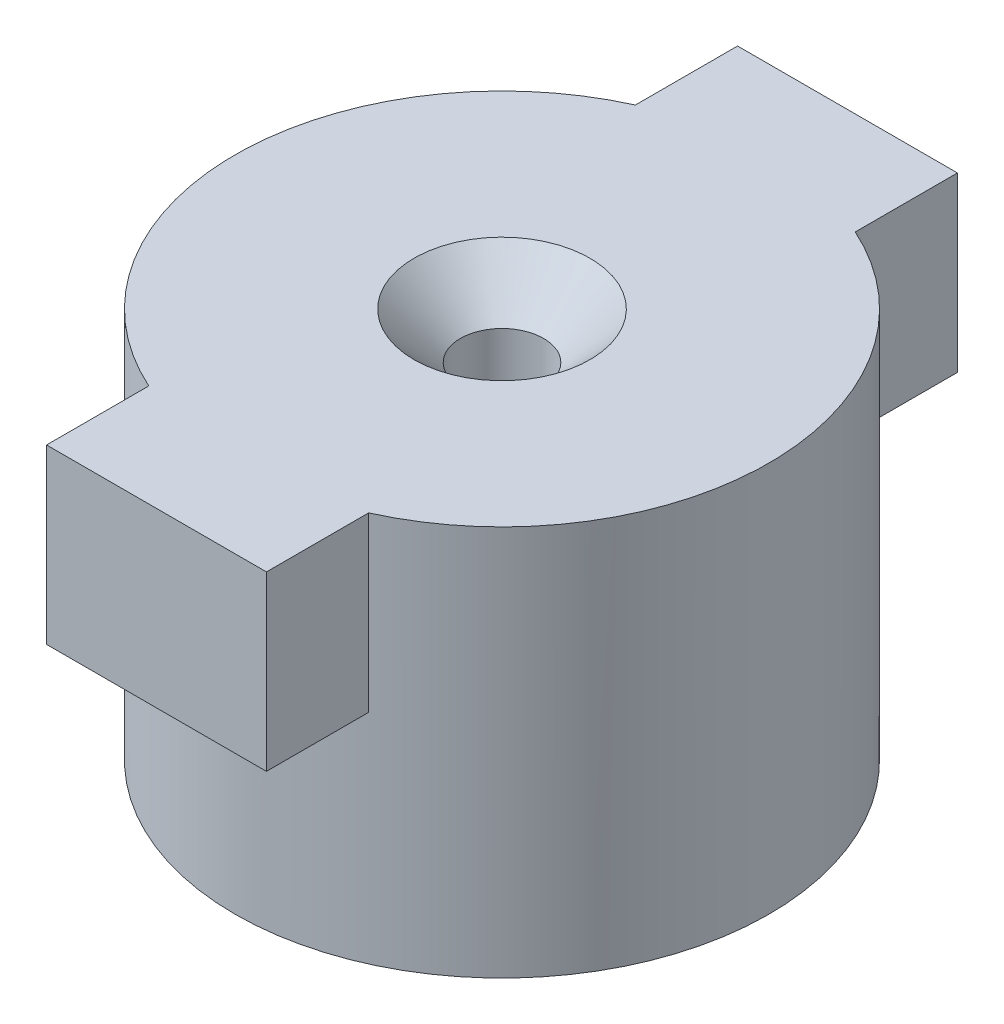
ISO-10303-21;
HEADER;
FILE_DESCRIPTION(('STEP AP214'),'2;1');
FILE_NAME('part.step','',(''),(''),'','','');
FILE_SCHEMA(('AUTOMOTIVE_DESIGN { 1 0 10303 214 1 1 1 1 }'));
ENDSEC;
DATA;
#1=APPLICATION_CONTEXT('core data for automotive mechanical design processes');
#2=APPLICATION_PROTOCOL_DEFINITION('international standard','automotive_design',2000,#1);
#3=PRODUCT_CONTEXT('',#1,'mechanical');
#4=PRODUCT('Part','Part','',(#3));
#5=PRODUCT_RELATED_PRODUCT_CATEGORY('part','',(#4));
#6=PRODUCT_DEFINITION_FORMATION('','',#4);
#7=PRODUCT_DEFINITION_CONTEXT('part definition',#1,'design');
#8=PRODUCT_DEFINITION('design','',#6,#7);
#9=PRODUCT_DEFINITION_SHAPE('','',#8);
#10=(LENGTH_UNIT() NAMED_UNIT(*) SI_UNIT(.MILLI.,.METRE.));
#11=(NAMED_UNIT(*) PLANE_ANGLE_UNIT() SI_UNIT($,.RADIAN.));
#12=(NAMED_UNIT(*) SI_UNIT($,.STERADIAN.) SOLID_ANGLE_UNIT());
#13=UNCERTAINTY_MEASURE_WITH_UNIT(LENGTH_MEASURE(1.E-05),#10,'distance_accuracy_value','');
#14=(GEOMETRIC_REPRESENTATION_CONTEXT(3) GLOBAL_UNCERTAINTY_ASSIGNED_CONTEXT((#13)) GLOBAL_UNIT_ASSIGNED_CONTEXT((#10,
#11,#12)) REPRESENTATION_CONTEXT('',''));
#15=CARTESIAN_POINT('',(0.,0.,0.));
#16=DIRECTION('',(0.,0.,1.));
#17=DIRECTION('',(1.,0.,0.));
#18=AXIS2_PLACEMENT_3D('',#15,#16,#17);
#19=CARTESIAN_POINT('',(0.,24.88,0.));
#20=DIRECTION('',(0.,-1.,0.));
#21=DIRECTION('',(0.,0.,-1.));
#22=AXIS2_PLACEMENT_3D('',#19,#20,#21);
#23=CYLINDRICAL_SURFACE('',#22,17.);
#24=CARTESIAN_POINT('',(0.,24.88,0.));
#25=DIRECTION('',(0.,1.,0.));
#26=DIRECTION('',(0.,0.,1.));
#27=AXIS2_PLACEMENT_3D('',#24,#25,#26);
#28=CIRCLE('',#27,17.);
#29=CARTESIAN_POINT('',(-7.,24.88,-15.4919333848297));
#30=VERTEX_POINT('',#29);
#31=CARTESIAN_POINT('',(-7.,24.88,15.4919333848297));
#32=VERTEX_POINT('',#31);
#33=EDGE_CURVE('E160',#30,#32,#28,.T.);
#34=ORIENTED_EDGE('',*,*,#33,.F.);
#35=DIRECTION('',(0.,-1.,0.));
#36=VECTOR('',#35,1.);
#37=CARTESIAN_POINT('',(-7.,24.88,-15.4919333848297));
#38=LINE('',#37,#36);
#39=CARTESIAN_POINT('',(-7.,13.88,-15.4919333848297));
#40=VERTEX_POINT('',#39);
#41=EDGE_CURVE('E155',#30,#40,#38,.T.);
#42=ORIENTED_EDGE('',*,*,#41,.T.);
#43=CARTESIAN_POINT('',(0.,13.88,0.));
#44=DIRECTION('',(0.,1.,0.));
#45=DIRECTION('',(0.,0.,1.));
#46=AXIS2_PLACEMENT_3D('',#43,#44,#45);
#47=CIRCLE('',#46,17.);
#48=CARTESIAN_POINT('',(7.,13.88,-15.4919333848297));
#49=VERTEX_POINT('',#48);
#50=EDGE_CURVE('E11',#49,#40,#47,.T.);
#51=ORIENTED_EDGE('',*,*,#50,.F.);
#52=DIRECTION('',(0.,-1.,0.));
#53=VECTOR('',#52,1.);
#54=CARTESIAN_POINT('',(7.,24.88,-15.4919333848297));
#55=LINE('',#54,#53);
#56=CARTESIAN_POINT('',(7.,24.88,-15.4919333848297));
#57=VERTEX_POINT('',#56);
#58=EDGE_CURVE('E144',#49,#57,#55,.F.);
#59=ORIENTED_EDGE('',*,*,#58,.T.);
#60=CARTESIAN_POINT('',(7.,24.88,15.4919333848297));
#61=VERTEX_POINT('',#60);
#62=EDGE_CURVE('E159',#61,#57,#28,.T.);
#63=ORIENTED_EDGE('',*,*,#62,.F.);
#64=DIRECTION('',(0.,-1.,0.));
#65=VECTOR('',#64,1.);
#66=CARTESIAN_POINT('',(7.,24.88,15.4919333848297));
#67=LINE('',#66,#65);
#68=CARTESIAN_POINT('',(7.,13.88,15.4919333848297));
#69=VERTEX_POINT('',#68);
#70=EDGE_CURVE('E151',#61,#69,#67,.T.);
#71=ORIENTED_EDGE('',*,*,#70,.T.);
#72=CARTESIAN_POINT('',(-7.,13.88,15.4919333848297));
#73=VERTEX_POINT('',#72);
#74=EDGE_CURVE('E40',#73,#69,#47,.T.);
#75=ORIENTED_EDGE('',*,*,#74,.F.);
#76=DIRECTION('',(0.,-1.,0.));
#77=VECTOR('',#76,1.);
#78=CARTESIAN_POINT('',(-7.,24.88,15.4919333848297));
#79=LINE('',#78,#77);
#80=EDGE_CURVE('E109',#73,#32,#79,.F.);
#81=ORIENTED_EDGE('',*,*,#80,.T.);
#82=EDGE_LOOP('',(#34,#42,#51,#59,#63,#71,#75,#81));
#83=FACE_BOUND('',#82,.T.);
#84=CARTESIAN_POINT('',(0.,0.,0.));
#85=DIRECTION('',(0.,1.,0.));
#86=DIRECTION('',(0.,0.,1.));
#87=AXIS2_PLACEMENT_3D('',#84,#85,#86);
#88=CIRCLE('',#87,17.);
#89=CARTESIAN_POINT('',(0.,0.,17.));
#90=VERTEX_POINT('',#89);
#91=EDGE_CURVE('E158',#90,#90,#88,.T.);
#92=ORIENTED_EDGE('',*,*,#91,.T.);
#93=EDGE_LOOP('',(#92));
#94=FACE_BOUND('',#93,.T.);
#95=ADVANCED_FACE('F37',(#83,#94),#23,.T.);
#96=CARTESIAN_POINT('',(0.,24.88,0.));
#97=DIRECTION('',(0.,1.,0.));
#98=DIRECTION('',(0.,0.,1.));
#99=AXIS2_PLACEMENT_3D('',#96,#97,#98);
#100=PLANE('',#99);
#101=CARTESIAN_POINT('',(0.,24.88,0.));
#102=DIRECTION('',(0.,1.,0.));
#103=DIRECTION('',(0.,0.,1.));
#104=AXIS2_PLACEMENT_3D('',#101,#102,#103);
#105=CIRCLE('',#104,5.6);
#106=CARTESIAN_POINT('',(0.,24.88,5.6));
#107=VERTEX_POINT('',#106);
#108=EDGE_CURVE('E325',#107,#107,#105,.T.);
#109=ORIENTED_EDGE('',*,*,#108,.F.);
#110=EDGE_LOOP('',(#109));
#111=FACE_BOUND('',#110,.T.);
#112=ORIENTED_EDGE('',*,*,#62,.T.);
#113=DIRECTION('',(0.,0.,-1.));
#114=VECTOR('',#113,1.);
#115=CARTESIAN_POINT('',(7.,24.88,-22.));
#116=LINE('',#115,#114);
#117=CARTESIAN_POINT('',(7.,24.88,-22.));
#118=VERTEX_POINT('',#117);
#119=EDGE_CURVE('E139',#57,#118,#116,.T.);
#120=ORIENTED_EDGE('',*,*,#119,.T.);
#121=DIRECTION('',(-1.,0.,0.));
#122=VECTOR('',#121,1.);
#123=CARTESIAN_POINT('',(-7.,24.88,-22.));
#124=LINE('',#123,#122);
#125=CARTESIAN_POINT('',(-7.,24.88,-22.));
#126=VERTEX_POINT('',#125);
#127=EDGE_CURVE('E114',#118,#126,#124,.T.);
#128=ORIENTED_EDGE('',*,*,#127,.T.);
#129=DIRECTION('',(0.,0.,1.));
#130=VECTOR('',#129,1.);
#131=CARTESIAN_POINT('',(-7.,24.88,-22.));
#132=LINE('',#131,#130);
#133=EDGE_CURVE('E51',#126,#30,#132,.T.);
#134=ORIENTED_EDGE('',*,*,#133,.T.);
#135=ORIENTED_EDGE('',*,*,#33,.T.);
#136=CARTESIAN_POINT('',(-7.,24.88,22.));
#137=VERTEX_POINT('',#136);
#138=EDGE_CURVE('E137',#32,#137,#132,.T.);
#139=ORIENTED_EDGE('',*,*,#138,.T.);
#140=DIRECTION('',(1.,0.,0.));
#141=VECTOR('',#140,1.);
#142=CARTESIAN_POINT('',(-7.,24.88,22.));
#143=LINE('',#142,#141);
#144=CARTESIAN_POINT('',(7.,24.88,22.));
#145=VERTEX_POINT('',#144);
#146=EDGE_CURVE('E120',#137,#145,#143,.T.);
#147=ORIENTED_EDGE('',*,*,#146,.T.);
#148=EDGE_CURVE('E58',#145,#61,#116,.T.);
#149=ORIENTED_EDGE('',*,*,#148,.T.);
#150=EDGE_LOOP('',(#112,#120,#128,#134,#135,#139,#147,#149));
#151=FACE_BOUND('',#150,.T.);
#152=ADVANCED_FACE('F165',(#111,#151),#100,.T.);
#153=CARTESIAN_POINT('',(0.,0.,0.));
#154=DIRECTION('',(0.,1.,0.));
#155=DIRECTION('',(0.,0.,1.));
#156=AXIS2_PLACEMENT_3D('',#153,#154,#155);
#157=PLANE('',#156);
#158=CARTESIAN_POINT('',(0.,0.,0.));
#159=DIRECTION('',(0.,1.,0.));
#160=DIRECTION('',(0.,0.,1.));
#161=AXIS2_PLACEMENT_3D('',#158,#159,#160);
#162=CIRCLE('',#161,2.64999999999999);
#163=CARTESIAN_POINT('',(0.,0.,2.64999999999999));
#164=VERTEX_POINT('',#163);
#165=EDGE_CURVE('E327',#164,#164,#162,.T.);
#166=ORIENTED_EDGE('',*,*,#165,.T.);
#167=EDGE_LOOP('',(#166));
#168=FACE_BOUND('',#167,.T.);
#169=ORIENTED_EDGE('',*,*,#91,.F.);
#170=EDGE_LOOP('',(#169));
#171=FACE_BOUND('',#170,.T.);
#172=ADVANCED_FACE('F198',(#168,#171),#157,.F.);
#173=CARTESIAN_POINT('',(-7.,13.88,22.));
#174=DIRECTION('',(0.,0.,1.));
#175=DIRECTION('',(1.,0.,0.));
#176=AXIS2_PLACEMENT_3D('',#173,#174,#175);
#177=PLANE('',#176);
#178=ORIENTED_EDGE('',*,*,#146,.F.);
#179=DIRECTION('',(0.,1.,0.));
#180=VECTOR('',#179,1.);
#181=CARTESIAN_POINT('',(-7.,13.88,22.));
#182=LINE('',#181,#180);
#183=CARTESIAN_POINT('',(-7.,13.88,22.));
#184=VERTEX_POINT('',#183);
#185=EDGE_CURVE('E106',#184,#137,#182,.T.);
#186=ORIENTED_EDGE('',*,*,#185,.F.);
#187=DIRECTION('',(1.,0.,0.));
#188=VECTOR('',#187,1.);
#189=CARTESIAN_POINT('',(-7.,13.88,22.));
#190=LINE('',#189,#188);
#191=CARTESIAN_POINT('',(7.,13.88,22.));
#192=VERTEX_POINT('',#191);
#193=EDGE_CURVE('E119',#184,#192,#190,.T.);
#194=ORIENTED_EDGE('',*,*,#193,.T.);
#195=DIRECTION('',(0.,1.,0.));
#196=VECTOR('',#195,1.);
#197=CARTESIAN_POINT('',(7.,13.88,22.));
#198=LINE('',#197,#196);
#199=EDGE_CURVE('E121',#192,#145,#198,.T.);
#200=ORIENTED_EDGE('',*,*,#199,.T.);
#201=EDGE_LOOP('',(#178,#186,#194,#200));
#202=FACE_BOUND('',#201,.T.);
#203=ADVANCED_FACE('F118',(#202),#177,.T.);
#204=CARTESIAN_POINT('',(0.,13.88,0.));
#205=DIRECTION('',(0.,1.,0.));
#206=DIRECTION('',(0.,0.,1.));
#207=AXIS2_PLACEMENT_3D('',#204,#205,#206);
#208=PLANE('',#207);
#209=DIRECTION('',(0.,0.,1.));
#210=VECTOR('',#209,1.);
#211=CARTESIAN_POINT('',(-7.,13.88,-22.));
#212=LINE('',#211,#210);
#213=EDGE_CURVE('E103',#73,#184,#212,.T.);
#214=ORIENTED_EDGE('',*,*,#213,.F.);
#215=ORIENTED_EDGE('',*,*,#74,.T.);
#216=DIRECTION('',(0.,0.,-1.));
#217=VECTOR('',#216,1.);
#218=CARTESIAN_POINT('',(7.,13.88,-22.));
#219=LINE('',#218,#217);
#220=EDGE_CURVE('E127',#192,#69,#219,.T.);
#221=ORIENTED_EDGE('',*,*,#220,.F.);
#222=ORIENTED_EDGE('',*,*,#193,.F.);
#223=EDGE_LOOP('',(#214,#215,#221,#222));
#224=FACE_BOUND('',#223,.T.);
#225=ADVANCED_FACE('F125',(#224),#208,.F.);
#226=CARTESIAN_POINT('',(7.,13.88,-22.));
#227=DIRECTION('',(1.,0.,0.));
#228=DIRECTION('',(0.,0.,-1.));
#229=AXIS2_PLACEMENT_3D('',#226,#227,#228);
#230=PLANE('',#229);
#231=ORIENTED_EDGE('',*,*,#70,.F.);
#232=ORIENTED_EDGE('',*,*,#148,.F.);
#233=ORIENTED_EDGE('',*,*,#199,.F.);
#234=ORIENTED_EDGE('',*,*,#220,.T.);
#235=EDGE_LOOP('',(#231,#232,#233,#234));
#236=FACE_BOUND('',#235,.T.);
#237=ADVANCED_FACE('F170',(#236),#230,.T.);
#238=CARTESIAN_POINT('',(-7.,13.88,-22.));
#239=DIRECTION('',(-1.,0.,0.));
#240=DIRECTION('',(0.,0.,1.));
#241=AXIS2_PLACEMENT_3D('',#238,#239,#240);
#242=PLANE('',#241);
#243=ORIENTED_EDGE('',*,*,#80,.F.);
#244=ORIENTED_EDGE('',*,*,#213,.T.);
#245=ORIENTED_EDGE('',*,*,#185,.T.);
#246=ORIENTED_EDGE('',*,*,#138,.F.);
#247=EDGE_LOOP('',(#243,#244,#245,#246));
#248=FACE_BOUND('',#247,.T.);
#249=ADVANCED_FACE('F105',(#248),#242,.T.);
#250=CARTESIAN_POINT('',(7.,13.88,-22.));
#251=VERTEX_POINT('',#250);
#252=EDGE_CURVE('E128',#49,#251,#219,.T.);
#253=ORIENTED_EDGE('',*,*,#252,.F.);
#254=ORIENTED_EDGE('',*,*,#50,.T.);
#255=CARTESIAN_POINT('',(-7.,13.88,-22.));
#256=VERTEX_POINT('',#255);
#257=EDGE_CURVE('E113',#256,#40,#212,.T.);
#258=ORIENTED_EDGE('',*,*,#257,.F.);
#259=DIRECTION('',(-1.,0.,0.));
#260=VECTOR('',#259,1.);
#261=CARTESIAN_POINT('',(-7.,13.88,-22.));
#262=LINE('',#261,#260);
#263=EDGE_CURVE('E122',#251,#256,#262,.T.);
#264=ORIENTED_EDGE('',*,*,#263,.F.);
#265=EDGE_LOOP('',(#253,#254,#258,#264));
#266=FACE_BOUND('',#265,.T.);
#267=ADVANCED_FACE('F183',(#266),#208,.F.);
#268=ORIENTED_EDGE('',*,*,#41,.F.);
#269=ORIENTED_EDGE('',*,*,#133,.F.);
#270=DIRECTION('',(0.,1.,0.));
#271=VECTOR('',#270,1.);
#272=CARTESIAN_POINT('',(-7.,13.88,-22.));
#273=LINE('',#272,#271);
#274=EDGE_CURVE('E142',#256,#126,#273,.T.);
#275=ORIENTED_EDGE('',*,*,#274,.F.);
#276=ORIENTED_EDGE('',*,*,#257,.T.);
#277=EDGE_LOOP('',(#268,#269,#275,#276));
#278=FACE_BOUND('',#277,.T.);
#279=ADVANCED_FACE('F181',(#278),#242,.T.);
#280=ORIENTED_EDGE('',*,*,#58,.F.);
#281=ORIENTED_EDGE('',*,*,#252,.T.);
#282=DIRECTION('',(0.,1.,0.));
#283=VECTOR('',#282,1.);
#284=CARTESIAN_POINT('',(7.,13.88,-22.));
#285=LINE('',#284,#283);
#286=EDGE_CURVE('E145',#251,#118,#285,.T.);
#287=ORIENTED_EDGE('',*,*,#286,.T.);
#288=ORIENTED_EDGE('',*,*,#119,.F.);
#289=EDGE_LOOP('',(#280,#281,#287,#288));
#290=FACE_BOUND('',#289,.T.);
#291=ADVANCED_FACE('F174',(#290),#230,.T.);
#292=CARTESIAN_POINT('',(-7.,13.88,-22.));
#293=DIRECTION('',(0.,0.,-1.));
#294=DIRECTION('',(-1.,0.,0.));
#295=AXIS2_PLACEMENT_3D('',#292,#293,#294);
#296=PLANE('',#295);
#297=ORIENTED_EDGE('',*,*,#127,.F.);
#298=ORIENTED_EDGE('',*,*,#286,.F.);
#299=ORIENTED_EDGE('',*,*,#263,.T.);
#300=ORIENTED_EDGE('',*,*,#274,.T.);
#301=EDGE_LOOP('',(#297,#298,#299,#300));
#302=FACE_BOUND('',#301,.T.);
#303=ADVANCED_FACE('F178',(#302),#296,.T.);
#304=CARTESIAN_POINT('',(0.,24.88,0.));
#305=DIRECTION('',(0.,1.,0.));
#306=DIRECTION('',(0.,0.,1.));
#307=AXIS2_PLACEMENT_3D('',#304,#305,#306);
#308=CYLINDRICAL_SURFACE('',#307,2.65);
#309=ORIENTED_EDGE('',*,*,#165,.F.);
#310=EDGE_LOOP('',(#309));
#311=FACE_BOUND('',#310,.T.);
#312=CARTESIAN_POINT('',(0.,21.93,0.));
#313=DIRECTION('',(0.,1.,0.));
#314=DIRECTION('',(0.,0.,1.));
#315=AXIS2_PLACEMENT_3D('',#312,#313,#314);
#316=CIRCLE('',#315,2.65);
#317=CARTESIAN_POINT('',(0.,21.93,2.65));
#318=VERTEX_POINT('',#317);
#319=EDGE_CURVE('E323',#318,#318,#316,.T.);
#320=ORIENTED_EDGE('',*,*,#319,.T.);
#321=EDGE_LOOP('',(#320));
#322=FACE_BOUND('',#321,.T.);
#323=ADVANCED_FACE('F211',(#311,#322),#308,.F.);
#324=CARTESIAN_POINT('',(0.,24.88,0.));
#325=DIRECTION('',(0.,1.,0.));
#326=DIRECTION('',(0.,0.,1.));
#327=AXIS2_PLACEMENT_3D('',#324,#325,#326);
#328=CONICAL_SURFACE('',#327,5.6,0.785398163397448);
#329=ORIENTED_EDGE('',*,*,#319,.F.);
#330=EDGE_LOOP('',(#329));
#331=FACE_BOUND('',#330,.T.);
#332=ORIENTED_EDGE('',*,*,#108,.T.);
#333=EDGE_LOOP('',(#332));
#334=FACE_BOUND('',#333,.T.);
#335=ADVANCED_FACE('F216',(#331,#334),#328,.F.);
#336=CLOSED_SHELL('',(#95,#152,#172,#203,#225,#237,#249,#267,#279,#291,#303,#323,#335));
#337=MANIFOLD_SOLID_BREP('B2',#336);
#338=ADVANCED_BREP_SHAPE_REPRESENTATION('',(#18,#337),#14);
#339=SHAPE_DEFINITION_REPRESENTATION(#9,#338);
ENDSEC;
END-ISO-10303-21;
